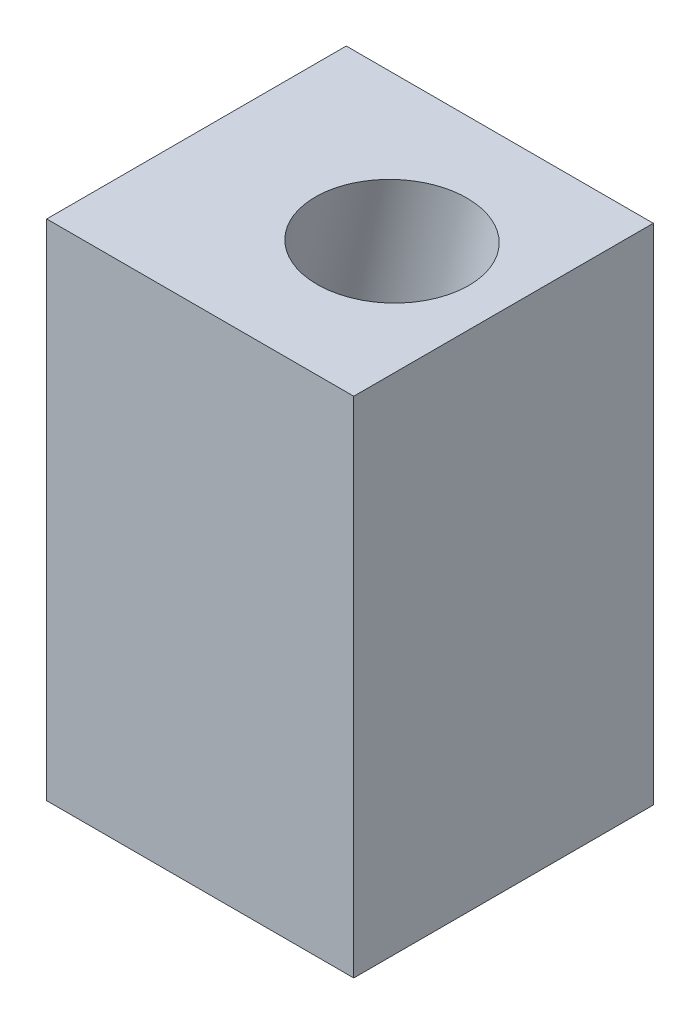
ISO-10303-21;
HEADER;
FILE_DESCRIPTION(('STEP AP214'),'2;1');
FILE_NAME('part.step','',(''),(''),'','','');
FILE_SCHEMA(('AUTOMOTIVE_DESIGN { 1 0 10303 214 1 1 1 1 }'));
ENDSEC;
DATA;
#1=APPLICATION_CONTEXT('core data for automotive mechanical design processes');
#2=APPLICATION_PROTOCOL_DEFINITION('international standard','automotive_design',2000,#1);
#3=PRODUCT_CONTEXT('',#1,'mechanical');
#4=PRODUCT('Part','Part','',(#3));
#5=PRODUCT_RELATED_PRODUCT_CATEGORY('part','',(#4));
#6=PRODUCT_DEFINITION_FORMATION('','',#4);
#7=PRODUCT_DEFINITION_CONTEXT('part definition',#1,'design');
#8=PRODUCT_DEFINITION('design','',#6,#7);
#9=PRODUCT_DEFINITION_SHAPE('','',#8);
#10=(LENGTH_UNIT() NAMED_UNIT(*) SI_UNIT(.MILLI.,.METRE.));
#11=(NAMED_UNIT(*) PLANE_ANGLE_UNIT() SI_UNIT($,.RADIAN.));
#12=(NAMED_UNIT(*) SI_UNIT($,.STERADIAN.) SOLID_ANGLE_UNIT());
#13=UNCERTAINTY_MEASURE_WITH_UNIT(LENGTH_MEASURE(1.E-05),#10,'distance_accuracy_value','');
#14=(GEOMETRIC_REPRESENTATION_CONTEXT(3) GLOBAL_UNCERTAINTY_ASSIGNED_CONTEXT((#13)) GLOBAL_UNIT_ASSIGNED_CONTEXT((#10,
#11,#12)) REPRESENTATION_CONTEXT('',''));
#15=CARTESIAN_POINT('',(0.,0.,0.));
#16=DIRECTION('',(0.,0.,1.));
#17=DIRECTION('',(1.,0.,0.));
#18=AXIS2_PLACEMENT_3D('',#15,#16,#17);
#19=CARTESIAN_POINT('',(13.0175,-21.3614,25.4));
#20=DIRECTION('',(-1.,0.,0.));
#21=DIRECTION('',(0.,0.,1.));
#22=AXIS2_PLACEMENT_3D('',#19,#20,#21);
#23=PLANE('',#22);
#24=DIRECTION('',(0.,1.,0.));
#25=VECTOR('',#24,1.);
#26=CARTESIAN_POINT('',(13.0175,-21.3614,0.));
#27=LINE('',#26,#25);
#28=CARTESIAN_POINT('',(13.0175,-21.3614,0.));
#29=VERTEX_POINT('',#28);
#30=CARTESIAN_POINT('',(13.0175,21.3614,0.));
#31=VERTEX_POINT('',#30);
#32=EDGE_CURVE('E98',#29,#31,#27,.T.);
#33=ORIENTED_EDGE('',*,*,#32,.T.);
#34=DIRECTION('',(0.,0.,-1.));
#35=VECTOR('',#34,1.);
#36=CARTESIAN_POINT('',(13.0175,21.3614,25.4));
#37=LINE('',#36,#35);
#38=CARTESIAN_POINT('',(13.0175,21.3614,25.4));
#39=VERTEX_POINT('',#38);
#40=EDGE_CURVE('E11',#39,#31,#37,.T.);
#41=ORIENTED_EDGE('',*,*,#40,.F.);
#42=DIRECTION('',(0.,1.,0.));
#43=VECTOR('',#42,1.);
#44=CARTESIAN_POINT('',(13.0175,-21.3614,25.4));
#45=LINE('',#44,#43);
#46=CARTESIAN_POINT('',(13.0175,-21.3614,25.4));
#47=VERTEX_POINT('',#46);
#48=EDGE_CURVE('E85',#47,#39,#45,.T.);
#49=ORIENTED_EDGE('',*,*,#48,.F.);
#50=DIRECTION('',(0.,0.,-1.));
#51=VECTOR('',#50,1.);
#52=CARTESIAN_POINT('',(13.0175,-21.3614,25.4));
#53=LINE('',#52,#51);
#54=EDGE_CURVE('E94',#47,#29,#53,.T.);
#55=ORIENTED_EDGE('',*,*,#54,.T.);
#56=EDGE_LOOP('',(#33,#41,#49,#55));
#57=FACE_BOUND('',#56,.T.);
#58=ADVANCED_FACE('F33',(#57),#23,.F.);
#59=CARTESIAN_POINT('',(-13.0175,21.3614,25.4));
#60=DIRECTION('',(0.,-1.,0.));
#61=DIRECTION('',(0.,0.,-1.));
#62=AXIS2_PLACEMENT_3D('',#59,#60,#61);
#63=PLANE('',#62);
#64=CARTESIAN_POINT('',(3.26123762615429,21.3614,12.3971871137769));
#65=DIRECTION('',(0.,-1.,0.));
#66=DIRECTION('',(1.,0.,0.));
#67=AXIS2_PLACEMENT_3D('',#64,#65,#66);
#68=ELLIPSE('',#67,6.50417491589713,6.35);
#69=CARTESIAN_POINT('',(9.76541254205143,21.3614,12.3971871137769));
#70=VERTEX_POINT('',#69);
#71=EDGE_CURVE('E36',#70,#70,#68,.F.);
#72=ORIENTED_EDGE('',*,*,#71,.F.);
#73=EDGE_LOOP('',(#72));
#74=FACE_BOUND('',#73,.T.);
#75=DIRECTION('',(-1.,0.,0.));
#76=VECTOR('',#75,1.);
#77=CARTESIAN_POINT('',(-13.0175,21.3614,0.));
#78=LINE('',#77,#76);
#79=CARTESIAN_POINT('',(-13.0175,21.3614,0.));
#80=VERTEX_POINT('',#79);
#81=EDGE_CURVE('E89',#31,#80,#78,.T.);
#82=ORIENTED_EDGE('',*,*,#81,.T.);
#83=DIRECTION('',(0.,0.,-1.));
#84=VECTOR('',#83,1.);
#85=CARTESIAN_POINT('',(-13.0175,21.3614,25.4));
#86=LINE('',#85,#84);
#87=CARTESIAN_POINT('',(-13.0175,21.3614,25.4));
#88=VERTEX_POINT('',#87);
#89=EDGE_CURVE('E42',#88,#80,#86,.T.);
#90=ORIENTED_EDGE('',*,*,#89,.F.);
#91=DIRECTION('',(-1.,0.,0.));
#92=VECTOR('',#91,1.);
#93=CARTESIAN_POINT('',(-13.0175,21.3614,25.4));
#94=LINE('',#93,#92);
#95=EDGE_CURVE('E80',#39,#88,#94,.T.);
#96=ORIENTED_EDGE('',*,*,#95,.F.);
#97=ORIENTED_EDGE('',*,*,#40,.T.);
#98=EDGE_LOOP('',(#82,#90,#96,#97));
#99=FACE_BOUND('',#98,.T.);
#100=ADVANCED_FACE('F88',(#74,#99),#63,.F.);
#101=CARTESIAN_POINT('',(-13.0175,-21.3614,25.4));
#102=DIRECTION('',(1.,0.,0.));
#103=DIRECTION('',(0.,0.,-1.));
#104=AXIS2_PLACEMENT_3D('',#101,#102,#103);
#105=PLANE('',#104);
#106=DIRECTION('',(0.,-1.,0.));
#107=VECTOR('',#106,1.);
#108=CARTESIAN_POINT('',(-13.0175,-21.3614,0.));
#109=LINE('',#108,#107);
#110=CARTESIAN_POINT('',(-13.0175,-21.3614,0.));
#111=VERTEX_POINT('',#110);
#112=EDGE_CURVE('E67',#80,#111,#109,.T.);
#113=ORIENTED_EDGE('',*,*,#112,.T.);
#114=DIRECTION('',(0.,0.,-1.));
#115=VECTOR('',#114,1.);
#116=CARTESIAN_POINT('',(-13.0175,-21.3614,25.4));
#117=LINE('',#116,#115);
#118=CARTESIAN_POINT('',(-13.0175,-21.3614,25.4));
#119=VERTEX_POINT('',#118);
#120=EDGE_CURVE('E90',#119,#111,#117,.T.);
#121=ORIENTED_EDGE('',*,*,#120,.F.);
#122=DIRECTION('',(0.,-1.,0.));
#123=VECTOR('',#122,1.);
#124=CARTESIAN_POINT('',(-13.0175,-21.3614,25.4));
#125=LINE('',#124,#123);
#126=EDGE_CURVE('E83',#88,#119,#125,.T.);
#127=ORIENTED_EDGE('',*,*,#126,.F.);
#128=ORIENTED_EDGE('',*,*,#89,.T.);
#129=EDGE_LOOP('',(#113,#121,#127,#128));
#130=FACE_BOUND('',#129,.T.);
#131=ADVANCED_FACE('F92',(#130),#105,.F.);
#132=CARTESIAN_POINT('',(-13.0175,-21.3614,25.4));
#133=DIRECTION('',(0.,1.,0.));
#134=DIRECTION('',(0.,0.,1.));
#135=AXIS2_PLACEMENT_3D('',#132,#133,#134);
#136=PLANE('',#135);
#137=DIRECTION('',(1.,0.,0.));
#138=VECTOR('',#137,1.);
#139=CARTESIAN_POINT('',(-13.0175,-21.3614,0.));
#140=LINE('',#139,#138);
#141=EDGE_CURVE('E73',#111,#29,#140,.T.);
#142=ORIENTED_EDGE('',*,*,#141,.T.);
#143=ORIENTED_EDGE('',*,*,#54,.F.);
#144=DIRECTION('',(1.,0.,0.));
#145=VECTOR('',#144,1.);
#146=CARTESIAN_POINT('',(-13.0175,-21.3614,25.4));
#147=LINE('',#146,#145);
#148=EDGE_CURVE('E50',#119,#47,#147,.T.);
#149=ORIENTED_EDGE('',*,*,#148,.F.);
#150=ORIENTED_EDGE('',*,*,#120,.T.);
#151=EDGE_LOOP('',(#142,#143,#149,#150));
#152=FACE_BOUND('',#151,.T.);
#153=ADVANCED_FACE('F105',(#152),#136,.F.);
#154=CARTESIAN_POINT('',(0.,0.,25.4));
#155=DIRECTION('',(0.,0.,-1.));
#156=DIRECTION('',(-1.,0.,0.));
#157=AXIS2_PLACEMENT_3D('',#154,#155,#156);
#158=PLANE('',#157);
#159=ORIENTED_EDGE('',*,*,#48,.T.);
#160=ORIENTED_EDGE('',*,*,#95,.T.);
#161=ORIENTED_EDGE('',*,*,#126,.T.);
#162=ORIENTED_EDGE('',*,*,#148,.T.);
#163=EDGE_LOOP('',(#159,#160,#161,#162));
#164=FACE_BOUND('',#163,.T.);
#165=ADVANCED_FACE('F81',(#164),#158,.F.);
#166=CARTESIAN_POINT('',(0.,0.,0.));
#167=DIRECTION('',(0.,0.,-1.));
#168=DIRECTION('',(-1.,0.,0.));
#169=AXIS2_PLACEMENT_3D('',#166,#167,#168);
#170=PLANE('',#169);
#171=ORIENTED_EDGE('',*,*,#32,.F.);
#172=ORIENTED_EDGE('',*,*,#141,.F.);
#173=ORIENTED_EDGE('',*,*,#112,.F.);
#174=ORIENTED_EDGE('',*,*,#81,.F.);
#175=EDGE_LOOP('',(#171,#172,#173,#174));
#176=FACE_BOUND('',#175,.T.);
#177=ADVANCED_FACE('F108',(#176),#170,.T.);
#178=CARTESIAN_POINT('',(-3.15367721035215,-7.57441090329744,12.3971871137769));
#179=DIRECTION('',(0.216439613938103,0.976296007119933,0.));
#180=DIRECTION('',(-0.976296007119933,0.216439613938103,0.));
#181=AXIS2_PLACEMENT_3D('',#178,#179,#180);
#182=CYLINDRICAL_SURFACE('',#181,6.35);
#183=CARTESIAN_POINT('',(-3.15367721035215,-7.57441090329744,12.3971871137769));
#184=DIRECTION('',(-0.216439613938103,-0.976296007119933,0.));
#185=DIRECTION('',(0.976296007119933,-0.216439613938103,0.));
#186=AXIS2_PLACEMENT_3D('',#183,#184,#185);
#187=CIRCLE('',#186,6.35);
#188=CARTESIAN_POINT('',(3.04580243485942,-8.9488024518044,12.3971871137769));
#189=VERTEX_POINT('',#188);
#190=EDGE_CURVE('E111',#189,#189,#187,.T.);
#191=ORIENTED_EDGE('',*,*,#190,.T.);
#192=EDGE_LOOP('',(#191));
#193=FACE_BOUND('',#192,.T.);
#194=ORIENTED_EDGE('',*,*,#71,.T.);
#195=EDGE_LOOP('',(#194));
#196=FACE_BOUND('',#195,.T.);
#197=ADVANCED_FACE('F118',(#193,#196),#182,.F.);
#198=CARTESIAN_POINT('',(-3.15367721035215,-7.57441090329744,12.3971871137769));
#199=DIRECTION('',(-0.216439613938103,-0.976296007119933,0.));
#200=DIRECTION('',(0.976296007119933,-0.216439613938103,0.));
#201=AXIS2_PLACEMENT_3D('',#198,#199,#200);
#202=PLANE('',#201);
#203=ORIENTED_EDGE('',*,*,#190,.F.);
#204=EDGE_LOOP('',(#203));
#205=FACE_BOUND('',#204,.T.);
#206=ADVANCED_FACE('F135',(#205),#202,.F.);
#207=CLOSED_SHELL('',(#58,#100,#131,#153,#165,#177,#197,#206));
#208=MANIFOLD_SOLID_BREP('B2',#207);
#209=ADVANCED_BREP_SHAPE_REPRESENTATION('',(#18,#208),#14);
#210=SHAPE_DEFINITION_REPRESENTATION(#9,#209);
ENDSEC;
END-ISO-10303-21;
